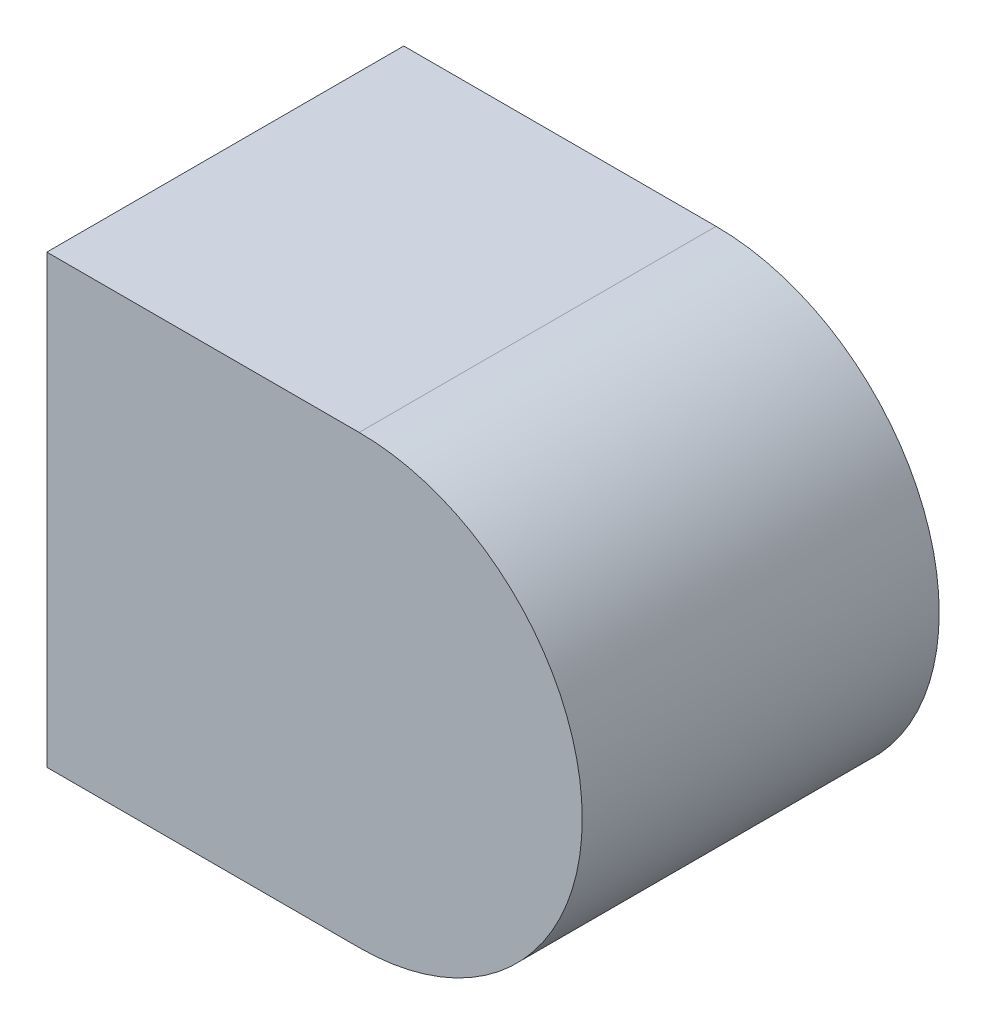
ISO-10303-21;
HEADER;
FILE_DESCRIPTION(('STEP AP214'),'2;1');
FILE_NAME('part.step','',(''),(''),'','','');
FILE_SCHEMA(('AUTOMOTIVE_DESIGN { 1 0 10303 214 1 1 1 1 }'));
ENDSEC;
DATA;
#1=APPLICATION_CONTEXT('core data for automotive mechanical design processes');
#2=APPLICATION_PROTOCOL_DEFINITION('international standard','automotive_design',2000,#1);
#3=PRODUCT_CONTEXT('',#1,'mechanical');
#4=PRODUCT('Part','Part','',(#3));
#5=PRODUCT_RELATED_PRODUCT_CATEGORY('part','',(#4));
#6=PRODUCT_DEFINITION_FORMATION('','',#4);
#7=PRODUCT_DEFINITION_CONTEXT('part definition',#1,'design');
#8=PRODUCT_DEFINITION('design','',#6,#7);
#9=PRODUCT_DEFINITION_SHAPE('','',#8);
#10=(LENGTH_UNIT() NAMED_UNIT(*) SI_UNIT(.MILLI.,.METRE.));
#11=(NAMED_UNIT(*) PLANE_ANGLE_UNIT() SI_UNIT($,.RADIAN.));
#12=(NAMED_UNIT(*) SI_UNIT($,.STERADIAN.) SOLID_ANGLE_UNIT());
#13=UNCERTAINTY_MEASURE_WITH_UNIT(LENGTH_MEASURE(1.E-05),#10,'distance_accuracy_value','');
#14=(GEOMETRIC_REPRESENTATION_CONTEXT(3) GLOBAL_UNCERTAINTY_ASSIGNED_CONTEXT((#13)) GLOBAL_UNIT_ASSIGNED_CONTEXT((#10,
#11,#12)) REPRESENTATION_CONTEXT('',''));
#15=CARTESIAN_POINT('',(0.,0.,0.));
#16=DIRECTION('',(0.,0.,1.));
#17=DIRECTION('',(1.,0.,0.));
#18=AXIS2_PLACEMENT_3D('',#15,#16,#17);
#19=CARTESIAN_POINT('',(-0.703,0.375,0.));
#20=DIRECTION('',(0.,1.,0.));
#21=DIRECTION('',(-1.,0.,0.));
#22=AXIS2_PLACEMENT_3D('',#19,#20,#21);
#23=PLANE('',#22);
#24=DIRECTION('',(0.,0.,1.));
#25=VECTOR('',#24,1.);
#26=CARTESIAN_POINT('',(-0.828,0.375,0.));
#27=LINE('',#26,#25);
#28=CARTESIAN_POINT('',(-0.828,0.375,0.));
#29=VERTEX_POINT('',#28);
#30=CARTESIAN_POINT('',(-0.828,0.375,0.2));
#31=VERTEX_POINT('',#30);
#32=EDGE_CURVE('E11',#29,#31,#27,.T.);
#33=ORIENTED_EDGE('',*,*,#32,.F.);
#34=DIRECTION('',(-1.,0.,0.));
#35=VECTOR('',#34,1.);
#36=CARTESIAN_POINT('',(-0.703,0.375,0.));
#37=LINE('',#36,#35);
#38=CARTESIAN_POINT('',(-1.003,0.375,0.));
#39=VERTEX_POINT('',#38);
#40=EDGE_CURVE('E24',#29,#39,#37,.T.);
#41=ORIENTED_EDGE('',*,*,#40,.T.);
#42=DIRECTION('',(0.,0.,1.));
#43=VECTOR('',#42,1.);
#44=CARTESIAN_POINT('',(-1.003,0.375,0.));
#45=LINE('',#44,#43);
#46=CARTESIAN_POINT('',(-1.003,0.375,0.2));
#47=VERTEX_POINT('',#46);
#48=EDGE_CURVE('E88',#39,#47,#45,.T.);
#49=ORIENTED_EDGE('',*,*,#48,.T.);
#50=DIRECTION('',(-1.,0.,0.));
#51=VECTOR('',#50,1.);
#52=CARTESIAN_POINT('',(-0.703,0.375,0.2));
#53=LINE('',#52,#51);
#54=EDGE_CURVE('E76',#31,#47,#53,.T.);
#55=ORIENTED_EDGE('',*,*,#54,.F.);
#56=EDGE_LOOP('',(#33,#41,#49,#55));
#57=FACE_BOUND('',#56,.T.);
#58=ADVANCED_FACE('F17',(#57),#23,.T.);
#59=CARTESIAN_POINT('',(-0.853,0.25,0.));
#60=DIRECTION('',(0.,0.,1.));
#61=DIRECTION('',(1.,0.,0.));
#62=AXIS2_PLACEMENT_3D('',#59,#60,#61);
#63=PLANE('',#62);
#64=CARTESIAN_POINT('',(-0.828,0.25,0.));
#65=DIRECTION('',(0.,0.,1.));
#66=DIRECTION('',(0.707106781186548,0.707106781186547,0.));
#67=AXIS2_PLACEMENT_3D('',#64,#65,#66);
#68=CIRCLE('',#67,0.125);
#69=CARTESIAN_POINT('',(-0.828,0.125,0.));
#70=VERTEX_POINT('',#69);
#71=EDGE_CURVE('E85',#70,#29,#68,.T.);
#72=ORIENTED_EDGE('',*,*,#71,.F.);
#73=DIRECTION('',(1.,0.,0.));
#74=VECTOR('',#73,1.);
#75=CARTESIAN_POINT('',(-1.003,0.125,0.));
#76=LINE('',#75,#74);
#77=CARTESIAN_POINT('',(-1.003,0.125,0.));
#78=VERTEX_POINT('',#77);
#79=EDGE_CURVE('E83',#78,#70,#76,.T.);
#80=ORIENTED_EDGE('',*,*,#79,.F.);
#81=DIRECTION('',(0.,-1.,0.));
#82=VECTOR('',#81,1.);
#83=CARTESIAN_POINT('',(-1.003,0.375,0.));
#84=LINE('',#83,#82);
#85=EDGE_CURVE('E72',#39,#78,#84,.T.);
#86=ORIENTED_EDGE('',*,*,#85,.F.);
#87=ORIENTED_EDGE('',*,*,#40,.F.);
#88=EDGE_LOOP('',(#72,#80,#86,#87));
#89=FACE_BOUND('',#88,.T.);
#90=ADVANCED_FACE('F90',(#89),#63,.F.);
#91=CARTESIAN_POINT('',(-0.828,0.25,0.));
#92=DIRECTION('',(0.,0.,1.));
#93=DIRECTION('',(0.707106781186547,-0.707106781186548,0.));
#94=AXIS2_PLACEMENT_3D('',#91,#92,#93);
#95=CYLINDRICAL_SURFACE('',#94,0.125);
#96=CARTESIAN_POINT('',(-0.828,0.25,0.2));
#97=DIRECTION('',(0.,0.,-1.));
#98=DIRECTION('',(0.707106781186548,0.707106781186547,0.));
#99=AXIS2_PLACEMENT_3D('',#96,#97,#98);
#100=CIRCLE('',#99,0.125);
#101=CARTESIAN_POINT('',(-0.828,0.125,0.2));
#102=VERTEX_POINT('',#101);
#103=EDGE_CURVE('E80',#31,#102,#100,.T.);
#104=ORIENTED_EDGE('',*,*,#103,.T.);
#105=DIRECTION('',(0.,0.,-1.));
#106=VECTOR('',#105,1.);
#107=CARTESIAN_POINT('',(-0.828,0.125,0.));
#108=LINE('',#107,#106);
#109=EDGE_CURVE('E60',#102,#70,#108,.T.);
#110=ORIENTED_EDGE('',*,*,#109,.T.);
#111=ORIENTED_EDGE('',*,*,#71,.T.);
#112=ORIENTED_EDGE('',*,*,#32,.T.);
#113=EDGE_LOOP('',(#104,#110,#111,#112));
#114=FACE_BOUND('',#113,.T.);
#115=ADVANCED_FACE('F91',(#114),#95,.T.);
#116=CARTESIAN_POINT('',(-1.003,0.125,0.));
#117=DIRECTION('',(0.,-1.,0.));
#118=DIRECTION('',(1.,0.,0.));
#119=AXIS2_PLACEMENT_3D('',#116,#117,#118);
#120=PLANE('',#119);
#121=ORIENTED_EDGE('',*,*,#109,.F.);
#122=DIRECTION('',(1.,0.,0.));
#123=VECTOR('',#122,1.);
#124=CARTESIAN_POINT('',(-1.003,0.125,0.2));
#125=LINE('',#124,#123);
#126=CARTESIAN_POINT('',(-1.003,0.125,0.2));
#127=VERTEX_POINT('',#126);
#128=EDGE_CURVE('E54',#127,#102,#125,.T.);
#129=ORIENTED_EDGE('',*,*,#128,.F.);
#130=DIRECTION('',(0.,0.,1.));
#131=VECTOR('',#130,1.);
#132=CARTESIAN_POINT('',(-1.003,0.125,0.));
#133=LINE('',#132,#131);
#134=EDGE_CURVE('E58',#78,#127,#133,.T.);
#135=ORIENTED_EDGE('',*,*,#134,.F.);
#136=ORIENTED_EDGE('',*,*,#79,.T.);
#137=EDGE_LOOP('',(#121,#129,#135,#136));
#138=FACE_BOUND('',#137,.T.);
#139=ADVANCED_FACE('F56',(#138),#120,.T.);
#140=CARTESIAN_POINT('',(-1.003,0.375,0.));
#141=DIRECTION('',(-1.,0.,0.));
#142=DIRECTION('',(0.,-1.,0.));
#143=AXIS2_PLACEMENT_3D('',#140,#141,#142);
#144=PLANE('',#143);
#145=ORIENTED_EDGE('',*,*,#85,.T.);
#146=ORIENTED_EDGE('',*,*,#134,.T.);
#147=DIRECTION('',(0.,-1.,0.));
#148=VECTOR('',#147,1.);
#149=CARTESIAN_POINT('',(-1.003,0.375,0.2));
#150=LINE('',#149,#148);
#151=EDGE_CURVE('E70',#47,#127,#150,.T.);
#152=ORIENTED_EDGE('',*,*,#151,.F.);
#153=ORIENTED_EDGE('',*,*,#48,.F.);
#154=EDGE_LOOP('',(#145,#146,#152,#153));
#155=FACE_BOUND('',#154,.T.);
#156=ADVANCED_FACE('F68',(#155),#144,.T.);
#157=CARTESIAN_POINT('',(-0.853,0.25,0.2));
#158=DIRECTION('',(0.,0.,1.));
#159=DIRECTION('',(1.,0.,0.));
#160=AXIS2_PLACEMENT_3D('',#157,#158,#159);
#161=PLANE('',#160);
#162=ORIENTED_EDGE('',*,*,#103,.F.);
#163=ORIENTED_EDGE('',*,*,#54,.T.);
#164=ORIENTED_EDGE('',*,*,#151,.T.);
#165=ORIENTED_EDGE('',*,*,#128,.T.);
#166=EDGE_LOOP('',(#162,#163,#164,#165));
#167=FACE_BOUND('',#166,.T.);
#168=ADVANCED_FACE('F75',(#167),#161,.T.);
#169=CLOSED_SHELL('',(#58,#90,#115,#139,#156,#168));
#170=MANIFOLD_SOLID_BREP('B1',#169);
#171=ADVANCED_BREP_SHAPE_REPRESENTATION('',(#18,#170),#14);
#172=SHAPE_DEFINITION_REPRESENTATION(#9,#171);
ENDSEC;
END-ISO-10303-21;
